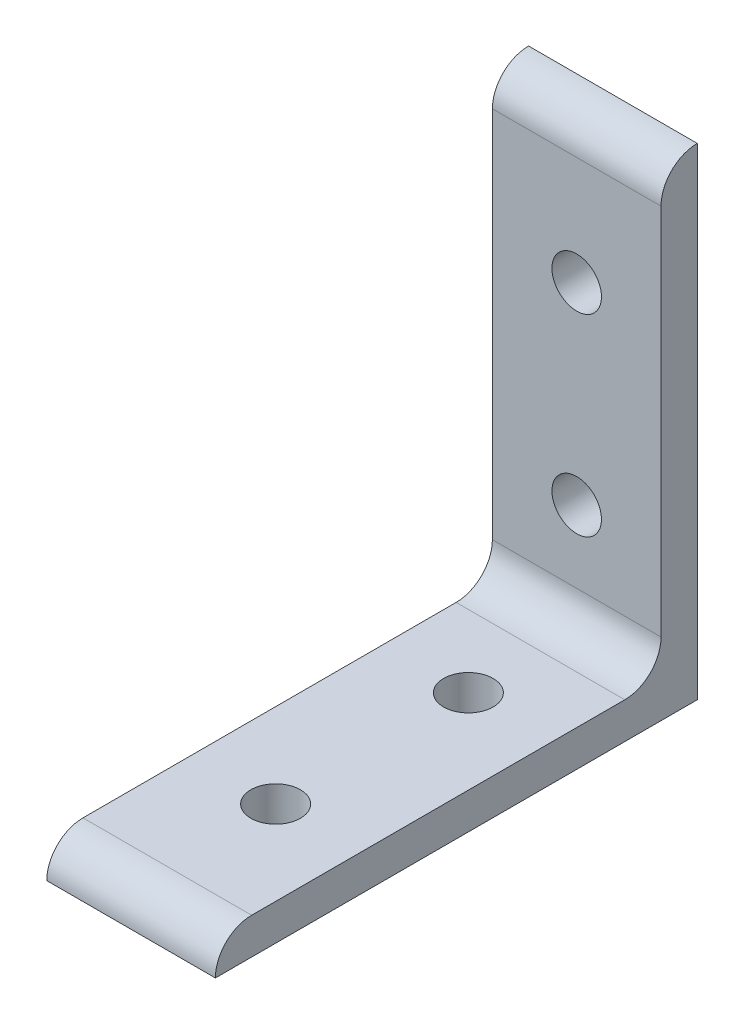
ISO-10303-21;
HEADER;
FILE_DESCRIPTION(('STEP AP214'),'2;1');
FILE_NAME('part.step','',(''),(''),'','','');
FILE_SCHEMA(('AUTOMOTIVE_DESIGN { 1 0 10303 214 1 1 1 1 }'));
ENDSEC;
DATA;
#1=APPLICATION_CONTEXT('core data for automotive mechanical design processes');
#2=APPLICATION_PROTOCOL_DEFINITION('international standard','automotive_design',2000,#1);
#3=PRODUCT_CONTEXT('',#1,'mechanical');
#4=PRODUCT('Part','Part','',(#3));
#5=PRODUCT_RELATED_PRODUCT_CATEGORY('part','',(#4));
#6=PRODUCT_DEFINITION_FORMATION('','',#4);
#7=PRODUCT_DEFINITION_CONTEXT('part definition',#1,'design');
#8=PRODUCT_DEFINITION('design','',#6,#7);
#9=PRODUCT_DEFINITION_SHAPE('','',#8);
#10=(LENGTH_UNIT() NAMED_UNIT(*) SI_UNIT(.MILLI.,.METRE.));
#11=(NAMED_UNIT(*) PLANE_ANGLE_UNIT() SI_UNIT($,.RADIAN.));
#12=(NAMED_UNIT(*) SI_UNIT($,.STERADIAN.) SOLID_ANGLE_UNIT());
#13=UNCERTAINTY_MEASURE_WITH_UNIT(LENGTH_MEASURE(1.E-05),#10,'distance_accuracy_value','');
#14=(GEOMETRIC_REPRESENTATION_CONTEXT(3) GLOBAL_UNCERTAINTY_ASSIGNED_CONTEXT((#13)) GLOBAL_UNIT_ASSIGNED_CONTEXT((#10,
#11,#12)) REPRESENTATION_CONTEXT('',''));
#15=CARTESIAN_POINT('',(0.,0.,0.));
#16=DIRECTION('',(0.,0.,1.));
#17=DIRECTION('',(1.,0.,0.));
#18=AXIS2_PLACEMENT_3D('',#15,#16,#17);
#19=CARTESIAN_POINT('',(22.225,-29.6060903168951,34.7540413800445));
#20=DIRECTION('',(-1.,0.,0.));
#21=DIRECTION('',(0.,0.,1.));
#22=AXIS2_PLACEMENT_3D('',#19,#20,#21);
#23=CYLINDRICAL_SURFACE('',#22,4.7752);
#24=CARTESIAN_POINT('',(0.,-29.6060903168951,34.7540413800445));
#25=DIRECTION('',(1.,0.,0.));
#26=DIRECTION('',(0.,0.,-1.));
#27=AXIS2_PLACEMENT_3D('',#24,#25,#26);
#28=CIRCLE('',#27,4.7752);
#29=CARTESIAN_POINT('',(0.,-24.8308903168951,34.7540413800445));
#30=VERTEX_POINT('',#29);
#31=CARTESIAN_POINT('',(0.,-29.6060903168951,39.5292413800445));
#32=VERTEX_POINT('',#31);
#33=EDGE_CURVE('E143',#30,#32,#28,.T.);
#34=ORIENTED_EDGE('',*,*,#33,.T.);
#35=DIRECTION('',(-1.,0.,0.));
#36=VECTOR('',#35,1.);
#37=CARTESIAN_POINT('',(22.225,-29.6060903168951,39.5292413800445));
#38=LINE('',#37,#36);
#39=CARTESIAN_POINT('',(22.225,-29.6060903168951,39.5292413800445));
#40=VERTEX_POINT('',#39);
#41=EDGE_CURVE('E158',#40,#32,#38,.T.);
#42=ORIENTED_EDGE('',*,*,#41,.F.);
#43=CARTESIAN_POINT('',(22.225,-29.6060903168951,34.7540413800445));
#44=DIRECTION('',(1.,0.,0.));
#45=DIRECTION('',(0.,0.,-1.));
#46=AXIS2_PLACEMENT_3D('',#43,#44,#45);
#47=CIRCLE('',#46,4.7752);
#48=CARTESIAN_POINT('',(22.225,-24.8308903168951,34.7540413800445));
#49=VERTEX_POINT('',#48);
#50=EDGE_CURVE('E144',#49,#40,#47,.T.);
#51=ORIENTED_EDGE('',*,*,#50,.F.);
#52=DIRECTION('',(-1.,0.,0.));
#53=VECTOR('',#52,1.);
#54=CARTESIAN_POINT('',(22.225,-24.8308903168951,34.7540413800445));
#55=LINE('',#54,#53);
#56=EDGE_CURVE('E150',#49,#30,#55,.T.);
#57=ORIENTED_EDGE('',*,*,#56,.T.);
#58=EDGE_LOOP('',(#34,#42,#51,#57));
#59=FACE_BOUND('',#58,.T.);
#60=ADVANCED_FACE('F35',(#59),#23,.T.);
#61=CARTESIAN_POINT('',(22.225,-29.6060903168951,-23.9707586199555));
#62=DIRECTION('',(0.,1.,0.));
#63=DIRECTION('',(0.,0.,1.));
#64=AXIS2_PLACEMENT_3D('',#61,#62,#63);
#65=PLANE('',#64);
#66=CARTESIAN_POINT('',(11.1125,-29.6060903168951,-4.92075861995548));
#67=DIRECTION('',(0.,1.,0.));
#68=DIRECTION('',(0.,0.,1.));
#69=AXIS2_PLACEMENT_3D('',#66,#67,#68);
#70=CIRCLE('',#69,3.2639);
#71=CARTESIAN_POINT('',(11.1125,-29.6060903168951,-1.65685861995548));
#72=VERTEX_POINT('',#71);
#73=EDGE_CURVE('E134',#72,#72,#70,.T.);
#74=ORIENTED_EDGE('',*,*,#73,.T.);
#75=EDGE_LOOP('',(#74));
#76=FACE_BOUND('',#75,.T.);
#77=CARTESIAN_POINT('',(11.1125,-29.6060903168951,20.4792413800445));
#78=DIRECTION('',(0.,1.,0.));
#79=DIRECTION('',(0.,0.,1.));
#80=AXIS2_PLACEMENT_3D('',#77,#78,#79);
#81=CIRCLE('',#80,3.2639);
#82=CARTESIAN_POINT('',(11.1125,-29.6060903168951,23.7431413800445));
#83=VERTEX_POINT('',#82);
#84=EDGE_CURVE('E140',#83,#83,#81,.T.);
#85=ORIENTED_EDGE('',*,*,#84,.T.);
#86=EDGE_LOOP('',(#85));
#87=FACE_BOUND('',#86,.T.);
#88=DIRECTION('',(0.,0.,-1.));
#89=VECTOR('',#88,1.);
#90=CARTESIAN_POINT('',(0.,-29.6060903168951,-23.9707586199555));
#91=LINE('',#90,#89);
#92=CARTESIAN_POINT('',(0.,-29.6060903168951,-23.9707586199555));
#93=VERTEX_POINT('',#92);
#94=EDGE_CURVE('E153',#32,#93,#91,.T.);
#95=ORIENTED_EDGE('',*,*,#94,.T.);
#96=DIRECTION('',(-1.,0.,0.));
#97=VECTOR('',#96,1.);
#98=CARTESIAN_POINT('',(22.225,-29.6060903168951,-23.9707586199555));
#99=LINE('',#98,#97);
#100=CARTESIAN_POINT('',(22.225,-29.6060903168951,-23.9707586199555));
#101=VERTEX_POINT('',#100);
#102=EDGE_CURVE('E114',#101,#93,#99,.T.);
#103=ORIENTED_EDGE('',*,*,#102,.F.);
#104=DIRECTION('',(0.,0.,-1.));
#105=VECTOR('',#104,1.);
#106=CARTESIAN_POINT('',(22.225,-29.6060903168951,-23.9707586199555));
#107=LINE('',#106,#105);
#108=EDGE_CURVE('E99',#40,#101,#107,.T.);
#109=ORIENTED_EDGE('',*,*,#108,.F.);
#110=ORIENTED_EDGE('',*,*,#41,.T.);
#111=EDGE_LOOP('',(#95,#103,#109,#110));
#112=FACE_BOUND('',#111,.T.);
#113=ADVANCED_FACE('F185',(#76,#87,#112),#65,.F.);
#114=CARTESIAN_POINT('',(22.225,-24.8308903168951,-19.1955586199554));
#115=DIRECTION('',(0.,-1.,0.));
#116=DIRECTION('',(0.,0.,-1.));
#117=AXIS2_PLACEMENT_3D('',#114,#115,#116);
#118=PLANE('',#117);
#119=CARTESIAN_POINT('',(11.1125,-24.8308903168951,-4.92075861995548));
#120=DIRECTION('',(0.,1.,0.));
#121=DIRECTION('',(0.,0.,1.));
#122=AXIS2_PLACEMENT_3D('',#119,#120,#121);
#123=CIRCLE('',#122,3.2639);
#124=CARTESIAN_POINT('',(11.1125,-24.8308903168951,-1.65685861995548));
#125=VERTEX_POINT('',#124);
#126=EDGE_CURVE('E113',#125,#125,#123,.T.);
#127=ORIENTED_EDGE('',*,*,#126,.F.);
#128=EDGE_LOOP('',(#127));
#129=FACE_BOUND('',#128,.T.);
#130=CARTESIAN_POINT('',(11.1125,-24.8308903168951,20.4792413800445));
#131=DIRECTION('',(0.,1.,0.));
#132=DIRECTION('',(0.,0.,1.));
#133=AXIS2_PLACEMENT_3D('',#130,#131,#132);
#134=CIRCLE('',#133,3.2639);
#135=CARTESIAN_POINT('',(11.1125,-24.8308903168951,23.7431413800445));
#136=VERTEX_POINT('',#135);
#137=EDGE_CURVE('E137',#136,#136,#134,.T.);
#138=ORIENTED_EDGE('',*,*,#137,.F.);
#139=EDGE_LOOP('',(#138));
#140=FACE_BOUND('',#139,.T.);
#141=DIRECTION('',(0.,0.,1.));
#142=VECTOR('',#141,1.);
#143=CARTESIAN_POINT('',(22.225,-24.8308903168951,-19.1955586199554));
#144=LINE('',#143,#142);
#145=CARTESIAN_POINT('',(22.225,-24.8308903168951,-14.4203586199554));
#146=VERTEX_POINT('',#145);
#147=EDGE_CURVE('E148',#146,#49,#144,.T.);
#148=ORIENTED_EDGE('',*,*,#147,.F.);
#149=DIRECTION('',(-1.,0.,0.));
#150=VECTOR('',#149,1.);
#151=CARTESIAN_POINT('',(0.,-24.8308903168951,-14.4203586199554));
#152=LINE('',#151,#150);
#153=CARTESIAN_POINT('',(0.,-24.8308903168951,-14.4203586199554));
#154=VERTEX_POINT('',#153);
#155=EDGE_CURVE('E161',#146,#154,#152,.T.);
#156=ORIENTED_EDGE('',*,*,#155,.T.);
#157=DIRECTION('',(0.,0.,1.));
#158=VECTOR('',#157,1.);
#159=CARTESIAN_POINT('',(0.,-24.8308903168951,-19.1955586199554));
#160=LINE('',#159,#158);
#161=EDGE_CURVE('E146',#154,#30,#160,.T.);
#162=ORIENTED_EDGE('',*,*,#161,.T.);
#163=ORIENTED_EDGE('',*,*,#56,.F.);
#164=EDGE_LOOP('',(#148,#156,#162,#163));
#165=FACE_BOUND('',#164,.T.);
#166=ADVANCED_FACE('F167',(#129,#140,#165),#118,.F.);
#167=CARTESIAN_POINT('',(22.225,-29.6060903168951,34.7540413800445));
#168=DIRECTION('',(1.,0.,0.));
#169=DIRECTION('',(0.,0.,-1.));
#170=AXIS2_PLACEMENT_3D('',#167,#168,#169);
#171=PLANE('',#170);
#172=ORIENTED_EDGE('',*,*,#50,.T.);
#173=ORIENTED_EDGE('',*,*,#108,.T.);
#174=DIRECTION('',(0.,-1.,0.));
#175=VECTOR('',#174,1.);
#176=CARTESIAN_POINT('',(22.225,-29.6060903168951,-23.9707586199555));
#177=LINE('',#176,#175);
#178=CARTESIAN_POINT('',(22.225,33.8939096831049,-23.9707586199548));
#179=VERTEX_POINT('',#178);
#180=EDGE_CURVE('E92',#179,#101,#177,.T.);
#181=ORIENTED_EDGE('',*,*,#180,.F.);
#182=CARTESIAN_POINT('',(22.225,29.1187096831049,-23.9707586199548));
#183=DIRECTION('',(-1.,0.,0.));
#184=DIRECTION('',(0.,-1.,0.));
#185=AXIS2_PLACEMENT_3D('',#182,#183,#184);
#186=CIRCLE('',#185,4.7752);
#187=CARTESIAN_POINT('',(22.225,29.1187096831049,-19.1955586199548));
#188=VERTEX_POINT('',#187);
#189=EDGE_CURVE('E97',#188,#179,#186,.T.);
#190=ORIENTED_EDGE('',*,*,#189,.F.);
#191=DIRECTION('',(0.,1.,0.));
#192=VECTOR('',#191,1.);
#193=CARTESIAN_POINT('',(22.225,-24.8308903168951,-19.1955586199554));
#194=LINE('',#193,#192);
#195=CARTESIAN_POINT('',(22.225,-20.055690316895,-19.1955586199554));
#196=VERTEX_POINT('',#195);
#197=EDGE_CURVE('E103',#196,#188,#194,.T.);
#198=ORIENTED_EDGE('',*,*,#197,.F.);
#199=CARTESIAN_POINT('',(22.225,-20.0556903168951,-14.4203586199554));
#200=DIRECTION('',(1.,0.,0.));
#201=DIRECTION('',(0.,0.,-1.));
#202=AXIS2_PLACEMENT_3D('',#199,#200,#201);
#203=CIRCLE('',#202,4.7752);
#204=EDGE_CURVE('E11',#196,#146,#203,.F.);
#205=ORIENTED_EDGE('',*,*,#204,.T.);
#206=ORIENTED_EDGE('',*,*,#147,.T.);
#207=EDGE_LOOP('',(#172,#173,#181,#190,#198,#205,#206));
#208=FACE_BOUND('',#207,.T.);
#209=ADVANCED_FACE('F95',(#208),#171,.T.);
#210=CARTESIAN_POINT('',(0.,-29.6060903168951,34.7540413800445));
#211=DIRECTION('',(1.,0.,0.));
#212=DIRECTION('',(0.,0.,-1.));
#213=AXIS2_PLACEMENT_3D('',#210,#211,#212);
#214=PLANE('',#213);
#215=ORIENTED_EDGE('',*,*,#33,.F.);
#216=ORIENTED_EDGE('',*,*,#161,.F.);
#217=CARTESIAN_POINT('',(0.,-20.0556903168951,-14.4203586199554));
#218=DIRECTION('',(1.,0.,0.));
#219=DIRECTION('',(0.,0.,-1.));
#220=AXIS2_PLACEMENT_3D('',#217,#218,#219);
#221=CIRCLE('',#220,4.7752);
#222=CARTESIAN_POINT('',(0.,-20.055690316895,-19.1955586199554));
#223=VERTEX_POINT('',#222);
#224=EDGE_CURVE('E43',#154,#223,#221,.T.);
#225=ORIENTED_EDGE('',*,*,#224,.T.);
#226=DIRECTION('',(0.,1.,0.));
#227=VECTOR('',#226,1.);
#228=CARTESIAN_POINT('',(0.,-24.8308903168951,-19.1955586199554));
#229=LINE('',#228,#227);
#230=CARTESIAN_POINT('',(0.,29.1187096831049,-19.1955586199548));
#231=VERTEX_POINT('',#230);
#232=EDGE_CURVE('E119',#223,#231,#229,.T.);
#233=ORIENTED_EDGE('',*,*,#232,.T.);
#234=CARTESIAN_POINT('',(0.,29.1187096831049,-23.9707586199548));
#235=DIRECTION('',(-1.,0.,0.));
#236=DIRECTION('',(0.,-1.,0.));
#237=AXIS2_PLACEMENT_3D('',#234,#235,#236);
#238=CIRCLE('',#237,4.7752);
#239=CARTESIAN_POINT('',(0.,33.8939096831049,-23.9707586199548));
#240=VERTEX_POINT('',#239);
#241=EDGE_CURVE('E127',#231,#240,#238,.T.);
#242=ORIENTED_EDGE('',*,*,#241,.T.);
#243=DIRECTION('',(0.,-1.,0.));
#244=VECTOR('',#243,1.);
#245=CARTESIAN_POINT('',(0.,-29.6060903168951,-23.9707586199555));
#246=LINE('',#245,#244);
#247=EDGE_CURVE('E109',#240,#93,#246,.T.);
#248=ORIENTED_EDGE('',*,*,#247,.T.);
#249=ORIENTED_EDGE('',*,*,#94,.F.);
#250=EDGE_LOOP('',(#215,#216,#225,#233,#242,#248,#249));
#251=FACE_BOUND('',#250,.T.);
#252=ADVANCED_FACE('F172',(#251),#214,.F.);
#253=CARTESIAN_POINT('',(11.1125,-47.0558903168951,20.4792413800445));
#254=DIRECTION('',(0.,1.,0.));
#255=DIRECTION('',(0.,0.,1.));
#256=AXIS2_PLACEMENT_3D('',#253,#254,#255);
#257=CYLINDRICAL_SURFACE('',#256,3.2639);
#258=ORIENTED_EDGE('',*,*,#137,.T.);
#259=EDGE_LOOP('',(#258));
#260=FACE_BOUND('',#259,.T.);
#261=ORIENTED_EDGE('',*,*,#84,.F.);
#262=EDGE_LOOP('',(#261));
#263=FACE_BOUND('',#262,.T.);
#264=ADVANCED_FACE('F197',(#260,#263),#257,.F.);
#265=CARTESIAN_POINT('',(11.1125,-47.0558903168951,-4.92075861995548));
#266=DIRECTION('',(0.,1.,0.));
#267=DIRECTION('',(0.,0.,1.));
#268=AXIS2_PLACEMENT_3D('',#265,#266,#267);
#269=CYLINDRICAL_SURFACE('',#268,3.2639);
#270=ORIENTED_EDGE('',*,*,#126,.T.);
#271=EDGE_LOOP('',(#270));
#272=FACE_BOUND('',#271,.T.);
#273=ORIENTED_EDGE('',*,*,#73,.F.);
#274=EDGE_LOOP('',(#273));
#275=FACE_BOUND('',#274,.T.);
#276=ADVANCED_FACE('F202',(#272,#275),#269,.F.);
#277=CARTESIAN_POINT('',(22.225,29.1187096831049,-23.9707586199548));
#278=DIRECTION('',(-1.,0.,0.));
#279=DIRECTION('',(0.,1.,0.));
#280=AXIS2_PLACEMENT_3D('',#277,#278,#279);
#281=CYLINDRICAL_SURFACE('',#280,4.7752);
#282=ORIENTED_EDGE('',*,*,#241,.F.);
#283=DIRECTION('',(-1.,0.,0.));
#284=VECTOR('',#283,1.);
#285=CARTESIAN_POINT('',(22.225,29.1187096831049,-19.1955586199548));
#286=LINE('',#285,#284);
#287=EDGE_CURVE('E118',#188,#231,#286,.T.);
#288=ORIENTED_EDGE('',*,*,#287,.F.);
#289=ORIENTED_EDGE('',*,*,#189,.T.);
#290=DIRECTION('',(-1.,0.,0.));
#291=VECTOR('',#290,1.);
#292=CARTESIAN_POINT('',(22.225,33.8939096831049,-23.9707586199548));
#293=LINE('',#292,#291);
#294=EDGE_CURVE('E106',#179,#240,#293,.T.);
#295=ORIENTED_EDGE('',*,*,#294,.T.);
#296=EDGE_LOOP('',(#282,#288,#289,#295));
#297=FACE_BOUND('',#296,.T.);
#298=ADVANCED_FACE('F116',(#297),#281,.T.);
#299=CARTESIAN_POINT('',(22.225,-29.6060903168951,-23.9707586199555));
#300=DIRECTION('',(0.,0.,1.));
#301=DIRECTION('',(0.,1.,0.));
#302=AXIS2_PLACEMENT_3D('',#299,#300,#301);
#303=PLANE('',#302);
#304=CARTESIAN_POINT('',(11.1125,-10.5560903168951,-23.9707586199553));
#305=DIRECTION('',(0.,0.,-1.));
#306=DIRECTION('',(0.,1.,0.));
#307=AXIS2_PLACEMENT_3D('',#304,#305,#306);
#308=CIRCLE('',#307,3.2639);
#309=CARTESIAN_POINT('',(11.1125,-7.29219031689509,-23.9707586199552));
#310=VERTEX_POINT('',#309);
#311=EDGE_CURVE('E227',#310,#310,#308,.T.);
#312=ORIENTED_EDGE('',*,*,#311,.F.);
#313=EDGE_LOOP('',(#312));
#314=FACE_BOUND('',#313,.T.);
#315=CARTESIAN_POINT('',(11.1125,14.8439096831049,-23.970758619955));
#316=DIRECTION('',(0.,0.,-1.));
#317=DIRECTION('',(0.,1.,0.));
#318=AXIS2_PLACEMENT_3D('',#315,#316,#317);
#319=CIRCLE('',#318,3.2639);
#320=CARTESIAN_POINT('',(11.1125,18.1078096831049,-23.970758619955));
#321=VERTEX_POINT('',#320);
#322=EDGE_CURVE('E123',#321,#321,#319,.T.);
#323=ORIENTED_EDGE('',*,*,#322,.F.);
#324=EDGE_LOOP('',(#323));
#325=FACE_BOUND('',#324,.T.);
#326=ORIENTED_EDGE('',*,*,#247,.F.);
#327=ORIENTED_EDGE('',*,*,#294,.F.);
#328=ORIENTED_EDGE('',*,*,#180,.T.);
#329=ORIENTED_EDGE('',*,*,#102,.T.);
#330=EDGE_LOOP('',(#326,#327,#328,#329));
#331=FACE_BOUND('',#330,.T.);
#332=ADVANCED_FACE('F107',(#314,#325,#331),#303,.F.);
#333=CARTESIAN_POINT('',(22.225,-24.8308903168951,-19.1955586199554));
#334=DIRECTION('',(0.,0.,-1.));
#335=DIRECTION('',(0.,-1.,0.));
#336=AXIS2_PLACEMENT_3D('',#333,#334,#335);
#337=PLANE('',#336);
#338=CARTESIAN_POINT('',(11.1125,-10.5560903168951,-19.1955586199553));
#339=DIRECTION('',(0.,0.,-1.));
#340=DIRECTION('',(0.,1.,0.));
#341=AXIS2_PLACEMENT_3D('',#338,#339,#340);
#342=CIRCLE('',#341,3.2639);
#343=CARTESIAN_POINT('',(11.1125,-7.29219031689514,-19.1955586199552));
#344=VERTEX_POINT('',#343);
#345=EDGE_CURVE('E230',#344,#344,#342,.T.);
#346=ORIENTED_EDGE('',*,*,#345,.T.);
#347=EDGE_LOOP('',(#346));
#348=FACE_BOUND('',#347,.T.);
#349=CARTESIAN_POINT('',(11.1125,14.8439096831049,-19.195558619955));
#350=DIRECTION('',(0.,0.,-1.));
#351=DIRECTION('',(0.,1.,0.));
#352=AXIS2_PLACEMENT_3D('',#349,#350,#351);
#353=CIRCLE('',#352,3.2639);
#354=CARTESIAN_POINT('',(11.1125,18.1078096831049,-19.195558619955));
#355=VERTEX_POINT('',#354);
#356=EDGE_CURVE('E223',#355,#355,#353,.T.);
#357=ORIENTED_EDGE('',*,*,#356,.T.);
#358=EDGE_LOOP('',(#357));
#359=FACE_BOUND('',#358,.T.);
#360=ORIENTED_EDGE('',*,*,#232,.F.);
#361=DIRECTION('',(-1.,0.,0.));
#362=VECTOR('',#361,1.);
#363=CARTESIAN_POINT('',(22.225,-20.055690316895,-19.1955586199554));
#364=LINE('',#363,#362);
#365=EDGE_CURVE('E50',#223,#196,#364,.F.);
#366=ORIENTED_EDGE('',*,*,#365,.T.);
#367=ORIENTED_EDGE('',*,*,#197,.T.);
#368=ORIENTED_EDGE('',*,*,#287,.T.);
#369=EDGE_LOOP('',(#360,#366,#367,#368));
#370=FACE_BOUND('',#369,.T.);
#371=ADVANCED_FACE('F211',(#348,#359,#370),#337,.F.);
#372=CARTESIAN_POINT('',(11.1125,14.8439096831051,-41.420558619955));
#373=DIRECTION('',(0.,0.,1.));
#374=DIRECTION('',(0.,1.,0.));
#375=AXIS2_PLACEMENT_3D('',#372,#373,#374);
#376=CYLINDRICAL_SURFACE('',#375,3.2639);
#377=ORIENTED_EDGE('',*,*,#356,.F.);
#378=EDGE_LOOP('',(#377));
#379=FACE_BOUND('',#378,.T.);
#380=ORIENTED_EDGE('',*,*,#322,.T.);
#381=EDGE_LOOP('',(#380));
#382=FACE_BOUND('',#381,.T.);
#383=ADVANCED_FACE('F181',(#379,#382),#376,.F.);
#384=CARTESIAN_POINT('',(11.1125,-10.5560903168949,-41.4205586199553));
#385=DIRECTION('',(0.,0.,1.));
#386=DIRECTION('',(0.,1.,0.));
#387=AXIS2_PLACEMENT_3D('',#384,#385,#386);
#388=CYLINDRICAL_SURFACE('',#387,3.2639);
#389=ORIENTED_EDGE('',*,*,#345,.F.);
#390=EDGE_LOOP('',(#389));
#391=FACE_BOUND('',#390,.T.);
#392=ORIENTED_EDGE('',*,*,#311,.T.);
#393=EDGE_LOOP('',(#392));
#394=FACE_BOUND('',#393,.T.);
#395=ADVANCED_FACE('F177',(#391,#394),#388,.F.);
#396=CARTESIAN_POINT('',(22.225,-20.0556903168951,-14.4203586199554));
#397=DIRECTION('',(1.,0.,0.));
#398=DIRECTION('',(0.,0.,-1.));
#399=AXIS2_PLACEMENT_3D('',#396,#397,#398);
#400=CYLINDRICAL_SURFACE('',#399,4.7752);
#401=ORIENTED_EDGE('',*,*,#204,.F.);
#402=ORIENTED_EDGE('',*,*,#365,.F.);
#403=ORIENTED_EDGE('',*,*,#224,.F.);
#404=ORIENTED_EDGE('',*,*,#155,.F.);
#405=EDGE_LOOP('',(#401,#402,#403,#404));
#406=FACE_BOUND('',#405,.T.);
#407=ADVANCED_FACE('F37',(#406),#400,.F.);
#408=CLOSED_SHELL('',(#60,#113,#166,#209,#252,#264,#276,#298,#332,#371,#383,#395,#407));
#409=MANIFOLD_SOLID_BREP('B2',#408);
#410=ADVANCED_BREP_SHAPE_REPRESENTATION('',(#18,#409),#14);
#411=SHAPE_DEFINITION_REPRESENTATION(#9,#410);
ENDSEC;
END-ISO-10303-21;
